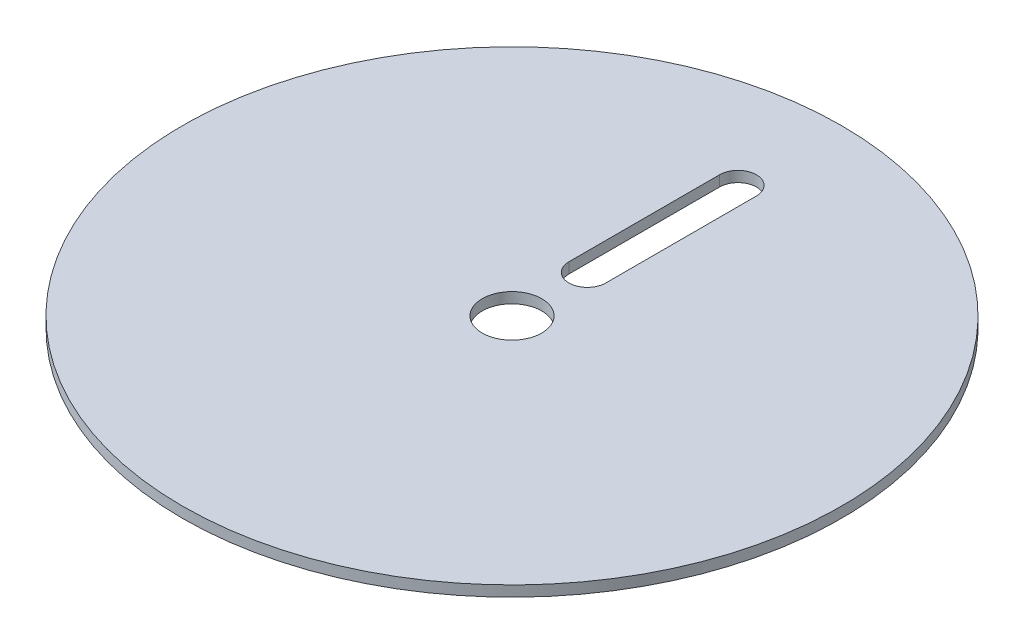
ISO-10303-21;
HEADER;
FILE_DESCRIPTION(('STEP AP214'),'2;1');
FILE_NAME('part.step','',(''),(''),'','','');
FILE_SCHEMA(('AUTOMOTIVE_DESIGN { 1 0 10303 214 1 1 1 1 }'));
ENDSEC;
DATA;
#1=APPLICATION_CONTEXT('core data for automotive mechanical design processes');
#2=APPLICATION_PROTOCOL_DEFINITION('international standard','automotive_design',2000,#1);
#3=PRODUCT_CONTEXT('',#1,'mechanical');
#4=PRODUCT('Part','Part','',(#3));
#5=PRODUCT_RELATED_PRODUCT_CATEGORY('part','',(#4));
#6=PRODUCT_DEFINITION_FORMATION('','',#4);
#7=PRODUCT_DEFINITION_CONTEXT('part definition',#1,'design');
#8=PRODUCT_DEFINITION('design','',#6,#7);
#9=PRODUCT_DEFINITION_SHAPE('','',#8);
#10=(LENGTH_UNIT() NAMED_UNIT(*) SI_UNIT(.MILLI.,.METRE.));
#11=(NAMED_UNIT(*) PLANE_ANGLE_UNIT() SI_UNIT($,.RADIAN.));
#12=(NAMED_UNIT(*) SI_UNIT($,.STERADIAN.) SOLID_ANGLE_UNIT());
#13=UNCERTAINTY_MEASURE_WITH_UNIT(LENGTH_MEASURE(1.E-05),#10,'distance_accuracy_value','');
#14=(GEOMETRIC_REPRESENTATION_CONTEXT(3) GLOBAL_UNCERTAINTY_ASSIGNED_CONTEXT((#13)) GLOBAL_UNIT_ASSIGNED_CONTEXT((#10,
#11,#12)) REPRESENTATION_CONTEXT('',''));
#15=CARTESIAN_POINT('',(0.,0.,0.));
#16=DIRECTION('',(0.,0.,1.));
#17=DIRECTION('',(1.,0.,0.));
#18=AXIS2_PLACEMENT_3D('',#15,#16,#17);
#19=CARTESIAN_POINT('',(0.,3.175,0.));
#20=DIRECTION('',(0.,1.,0.));
#21=DIRECTION('',(0.,0.,1.));
#22=AXIS2_PLACEMENT_3D('',#19,#20,#21);
#23=PLANE('',#22);
#24=DIRECTION('',(0.,0.,-1.));
#25=VECTOR('',#24,1.);
#26=CARTESIAN_POINT('',(5.5,3.175,-22.5));
#27=LINE('',#26,#25);
#28=CARTESIAN_POINT('',(5.5,3.175,-22.5));
#29=VERTEX_POINT('',#28);
#30=CARTESIAN_POINT('',(5.5,3.175,-67.5));
#31=VERTEX_POINT('',#30);
#32=EDGE_CURVE('E88',#29,#31,#27,.T.);
#33=ORIENTED_EDGE('',*,*,#32,.F.);
#34=CARTESIAN_POINT('',(0.,3.175,-22.5));
#35=DIRECTION('',(0.,1.,0.));
#36=DIRECTION('',(0.,0.,1.));
#37=AXIS2_PLACEMENT_3D('',#34,#35,#36);
#38=CIRCLE('',#37,5.5);
#39=CARTESIAN_POINT('',(-5.5,3.175,-22.5));
#40=VERTEX_POINT('',#39);
#41=EDGE_CURVE('E80',#40,#29,#38,.T.);
#42=ORIENTED_EDGE('',*,*,#41,.F.);
#43=DIRECTION('',(0.,0.,1.));
#44=VECTOR('',#43,1.);
#45=CARTESIAN_POINT('',(-5.5,3.175,-22.5));
#46=LINE('',#45,#44);
#47=CARTESIAN_POINT('',(-5.5,3.175,-67.5));
#48=VERTEX_POINT('',#47);
#49=EDGE_CURVE('E102',#48,#40,#46,.T.);
#50=ORIENTED_EDGE('',*,*,#49,.F.);
#51=CARTESIAN_POINT('',(0.,3.175,-67.5));
#52=DIRECTION('',(0.,1.,0.));
#53=DIRECTION('',(0.,0.,1.));
#54=AXIS2_PLACEMENT_3D('',#51,#52,#53);
#55=CIRCLE('',#54,5.5);
#56=EDGE_CURVE('E100',#31,#48,#55,.T.);
#57=ORIENTED_EDGE('',*,*,#56,.F.);
#58=EDGE_LOOP('',(#33,#42,#50,#57));
#59=FACE_BOUND('',#58,.T.);
#60=CARTESIAN_POINT('',(0.,3.175,0.));
#61=DIRECTION('',(0.,1.,0.));
#62=DIRECTION('',(0.,0.,1.));
#63=AXIS2_PLACEMENT_3D('',#60,#61,#62);
#64=CIRCLE('',#63,98.425);
#65=CARTESIAN_POINT('',(0.,3.175,98.425));
#66=VERTEX_POINT('',#65);
#67=EDGE_CURVE('E11',#66,#66,#64,.T.);
#68=ORIENTED_EDGE('',*,*,#67,.T.);
#69=EDGE_LOOP('',(#68));
#70=FACE_BOUND('',#69,.T.);
#71=CARTESIAN_POINT('',(0.,3.175,0.));
#72=DIRECTION('',(0.,1.,0.));
#73=DIRECTION('',(0.,0.,1.));
#74=AXIS2_PLACEMENT_3D('',#71,#72,#73);
#75=CIRCLE('',#74,8.89);
#76=CARTESIAN_POINT('',(0.,3.175,8.89));
#77=VERTEX_POINT('',#76);
#78=EDGE_CURVE('E108',#77,#77,#75,.T.);
#79=ORIENTED_EDGE('',*,*,#78,.F.);
#80=EDGE_LOOP('',(#79));
#81=FACE_BOUND('',#80,.T.);
#82=ADVANCED_FACE('F39',(#59,#70,#81),#23,.T.);
#83=CARTESIAN_POINT('',(0.,0.,0.));
#84=DIRECTION('',(0.,1.,0.));
#85=DIRECTION('',(0.,0.,1.));
#86=AXIS2_PLACEMENT_3D('',#83,#84,#85);
#87=PLANE('',#86);
#88=CARTESIAN_POINT('',(0.,0.,0.));
#89=DIRECTION('',(0.,1.,0.));
#90=DIRECTION('',(0.,0.,1.));
#91=AXIS2_PLACEMENT_3D('',#88,#89,#90);
#92=CIRCLE('',#91,98.425);
#93=CARTESIAN_POINT('',(0.,0.,98.425));
#94=VERTEX_POINT('',#93);
#95=EDGE_CURVE('E43',#94,#94,#92,.T.);
#96=ORIENTED_EDGE('',*,*,#95,.F.);
#97=EDGE_LOOP('',(#96));
#98=FACE_BOUND('',#97,.T.);
#99=CARTESIAN_POINT('',(0.,0.,-22.5));
#100=DIRECTION('',(0.,1.,0.));
#101=DIRECTION('',(0.,0.,1.));
#102=AXIS2_PLACEMENT_3D('',#99,#100,#101);
#103=CIRCLE('',#102,5.5);
#104=CARTESIAN_POINT('',(-5.5,0.,-22.5));
#105=VERTEX_POINT('',#104);
#106=CARTESIAN_POINT('',(5.5,0.,-22.5));
#107=VERTEX_POINT('',#106);
#108=EDGE_CURVE('E62',#105,#107,#103,.T.);
#109=ORIENTED_EDGE('',*,*,#108,.T.);
#110=DIRECTION('',(0.,0.,-1.));
#111=VECTOR('',#110,1.);
#112=CARTESIAN_POINT('',(5.5,0.,-22.5));
#113=LINE('',#112,#111);
#114=CARTESIAN_POINT('',(5.5,0.,-67.5));
#115=VERTEX_POINT('',#114);
#116=EDGE_CURVE('E95',#107,#115,#113,.T.);
#117=ORIENTED_EDGE('',*,*,#116,.T.);
#118=CARTESIAN_POINT('',(0.,0.,-67.5));
#119=DIRECTION('',(0.,1.,0.));
#120=DIRECTION('',(0.,0.,1.));
#121=AXIS2_PLACEMENT_3D('',#118,#119,#120);
#122=CIRCLE('',#121,5.5);
#123=CARTESIAN_POINT('',(-5.5,0.,-67.5));
#124=VERTEX_POINT('',#123);
#125=EDGE_CURVE('E110',#115,#124,#122,.T.);
#126=ORIENTED_EDGE('',*,*,#125,.T.);
#127=DIRECTION('',(0.,0.,1.));
#128=VECTOR('',#127,1.);
#129=CARTESIAN_POINT('',(-5.5,0.,-22.5));
#130=LINE('',#129,#128);
#131=EDGE_CURVE('E89',#124,#105,#130,.T.);
#132=ORIENTED_EDGE('',*,*,#131,.T.);
#133=EDGE_LOOP('',(#109,#117,#126,#132));
#134=FACE_BOUND('',#133,.T.);
#135=CARTESIAN_POINT('',(0.,0.,0.));
#136=DIRECTION('',(0.,1.,0.));
#137=DIRECTION('',(0.,0.,1.));
#138=AXIS2_PLACEMENT_3D('',#135,#136,#137);
#139=CIRCLE('',#138,8.89);
#140=CARTESIAN_POINT('',(0.,0.,8.89));
#141=VERTEX_POINT('',#140);
#142=EDGE_CURVE('E199',#141,#141,#139,.T.);
#143=ORIENTED_EDGE('',*,*,#142,.T.);
#144=EDGE_LOOP('',(#143));
#145=FACE_BOUND('',#144,.T.);
#146=ADVANCED_FACE('F121',(#98,#134,#145),#87,.F.);
#147=CARTESIAN_POINT('',(0.,3.175,0.));
#148=DIRECTION('',(0.,-1.,0.));
#149=DIRECTION('',(0.,0.,-1.));
#150=AXIS2_PLACEMENT_3D('',#147,#148,#149);
#151=CYLINDRICAL_SURFACE('',#150,98.425);
#152=ORIENTED_EDGE('',*,*,#67,.F.);
#153=EDGE_LOOP('',(#152));
#154=FACE_BOUND('',#153,.T.);
#155=ORIENTED_EDGE('',*,*,#95,.T.);
#156=EDGE_LOOP('',(#155));
#157=FACE_BOUND('',#156,.T.);
#158=ADVANCED_FACE('F41',(#154,#157),#151,.T.);
#159=CARTESIAN_POINT('',(0.,3.175,-22.5));
#160=DIRECTION('',(0.,-1.,0.));
#161=DIRECTION('',(0.,0.,-1.));
#162=AXIS2_PLACEMENT_3D('',#159,#160,#161);
#163=CYLINDRICAL_SURFACE('',#162,5.5);
#164=ORIENTED_EDGE('',*,*,#108,.F.);
#165=DIRECTION('',(0.,-1.,0.));
#166=VECTOR('',#165,1.);
#167=CARTESIAN_POINT('',(-5.5,3.175,-22.5));
#168=LINE('',#167,#166);
#169=EDGE_CURVE('E84',#40,#105,#168,.T.);
#170=ORIENTED_EDGE('',*,*,#169,.F.);
#171=ORIENTED_EDGE('',*,*,#41,.T.);
#172=DIRECTION('',(0.,-1.,0.));
#173=VECTOR('',#172,1.);
#174=CARTESIAN_POINT('',(5.5,3.175,-22.5));
#175=LINE('',#174,#173);
#176=EDGE_CURVE('E83',#29,#107,#175,.T.);
#177=ORIENTED_EDGE('',*,*,#176,.T.);
#178=EDGE_LOOP('',(#164,#170,#171,#177));
#179=FACE_BOUND('',#178,.T.);
#180=ADVANCED_FACE('F82',(#179),#163,.F.);
#181=CARTESIAN_POINT('',(5.5,3.175,-22.5));
#182=DIRECTION('',(-1.,0.,0.));
#183=DIRECTION('',(0.,0.,1.));
#184=AXIS2_PLACEMENT_3D('',#181,#182,#183);
#185=PLANE('',#184);
#186=ORIENTED_EDGE('',*,*,#116,.F.);
#187=ORIENTED_EDGE('',*,*,#176,.F.);
#188=ORIENTED_EDGE('',*,*,#32,.T.);
#189=DIRECTION('',(0.,-1.,0.));
#190=VECTOR('',#189,1.);
#191=CARTESIAN_POINT('',(5.5,3.175,-67.5));
#192=LINE('',#191,#190);
#193=EDGE_CURVE('E96',#31,#115,#192,.T.);
#194=ORIENTED_EDGE('',*,*,#193,.T.);
#195=EDGE_LOOP('',(#186,#187,#188,#194));
#196=FACE_BOUND('',#195,.T.);
#197=ADVANCED_FACE('F92',(#196),#185,.T.);
#198=CARTESIAN_POINT('',(0.,3.175,-67.5));
#199=DIRECTION('',(0.,-1.,0.));
#200=DIRECTION('',(0.,0.,-1.));
#201=AXIS2_PLACEMENT_3D('',#198,#199,#200);
#202=CYLINDRICAL_SURFACE('',#201,5.5);
#203=ORIENTED_EDGE('',*,*,#125,.F.);
#204=ORIENTED_EDGE('',*,*,#193,.F.);
#205=ORIENTED_EDGE('',*,*,#56,.T.);
#206=DIRECTION('',(0.,-1.,0.));
#207=VECTOR('',#206,1.);
#208=CARTESIAN_POINT('',(-5.5,3.175,-67.5));
#209=LINE('',#208,#207);
#210=EDGE_CURVE('E54',#48,#124,#209,.T.);
#211=ORIENTED_EDGE('',*,*,#210,.T.);
#212=EDGE_LOOP('',(#203,#204,#205,#211));
#213=FACE_BOUND('',#212,.T.);
#214=ADVANCED_FACE('F119',(#213),#202,.F.);
#215=CARTESIAN_POINT('',(-5.5,3.175,-22.5));
#216=DIRECTION('',(1.,0.,0.));
#217=DIRECTION('',(0.,0.,-1.));
#218=AXIS2_PLACEMENT_3D('',#215,#216,#217);
#219=PLANE('',#218);
#220=ORIENTED_EDGE('',*,*,#131,.F.);
#221=ORIENTED_EDGE('',*,*,#210,.F.);
#222=ORIENTED_EDGE('',*,*,#49,.T.);
#223=ORIENTED_EDGE('',*,*,#169,.T.);
#224=EDGE_LOOP('',(#220,#221,#222,#223));
#225=FACE_BOUND('',#224,.T.);
#226=ADVANCED_FACE('F123',(#225),#219,.T.);
#227=CARTESIAN_POINT('',(0.,3.175,0.));
#228=DIRECTION('',(0.,-1.,0.));
#229=DIRECTION('',(0.,0.,-1.));
#230=AXIS2_PLACEMENT_3D('',#227,#228,#229);
#231=CYLINDRICAL_SURFACE('',#230,8.89);
#232=ORIENTED_EDGE('',*,*,#78,.T.);
#233=EDGE_LOOP('',(#232));
#234=FACE_BOUND('',#233,.T.);
#235=ORIENTED_EDGE('',*,*,#142,.F.);
#236=EDGE_LOOP('',(#235));
#237=FACE_BOUND('',#236,.T.);
#238=ADVANCED_FACE('F125',(#234,#237),#231,.F.);
#239=CLOSED_SHELL('',(#82,#146,#158,#180,#197,#214,#226,#238));
#240=MANIFOLD_SOLID_BREP('B2',#239);
#241=ADVANCED_BREP_SHAPE_REPRESENTATION('',(#18,#240),#14);
#242=SHAPE_DEFINITION_REPRESENTATION(#9,#241);
ENDSEC;
END-ISO-10303-21;
